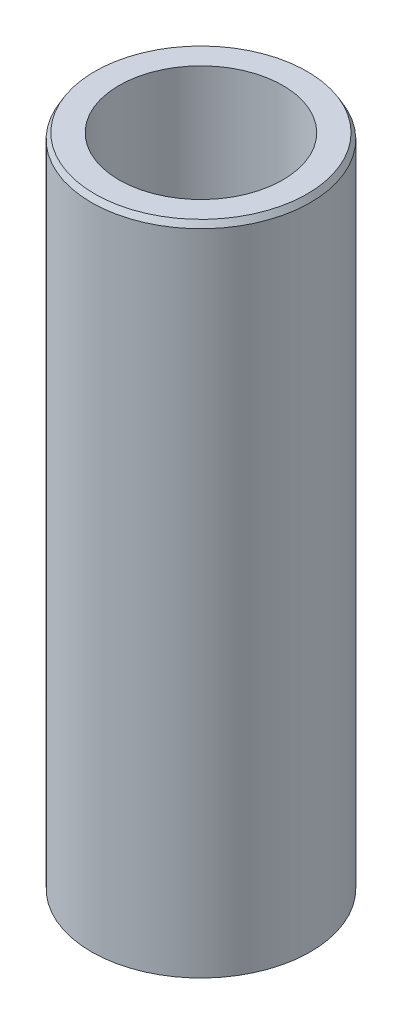
ISO-10303-21;
HEADER;
FILE_DESCRIPTION(('STEP AP214'),'2;1');
FILE_NAME('part.step','',(''),(''),'','','');
FILE_SCHEMA(('AUTOMOTIVE_DESIGN { 1 0 10303 214 1 1 1 1 }'));
ENDSEC;
DATA;
#1=APPLICATION_CONTEXT('core data for automotive mechanical design processes');
#2=APPLICATION_PROTOCOL_DEFINITION('international standard','automotive_design',2000,#1);
#3=PRODUCT_CONTEXT('',#1,'mechanical');
#4=PRODUCT('Part','Part','',(#3));
#5=PRODUCT_RELATED_PRODUCT_CATEGORY('part','',(#4));
#6=PRODUCT_DEFINITION_FORMATION('','',#4);
#7=PRODUCT_DEFINITION_CONTEXT('part definition',#1,'design');
#8=PRODUCT_DEFINITION('design','',#6,#7);
#9=PRODUCT_DEFINITION_SHAPE('','',#8);
#10=(LENGTH_UNIT() NAMED_UNIT(*) SI_UNIT(.MILLI.,.METRE.));
#11=(NAMED_UNIT(*) PLANE_ANGLE_UNIT() SI_UNIT($,.RADIAN.));
#12=(NAMED_UNIT(*) SI_UNIT($,.STERADIAN.) SOLID_ANGLE_UNIT());
#13=UNCERTAINTY_MEASURE_WITH_UNIT(LENGTH_MEASURE(1.E-05),#10,'distance_accuracy_value','');
#14=(GEOMETRIC_REPRESENTATION_CONTEXT(3) GLOBAL_UNCERTAINTY_ASSIGNED_CONTEXT((#13)) GLOBAL_UNIT_ASSIGNED_CONTEXT((#10,
#11,#12)) REPRESENTATION_CONTEXT('',''));
#15=CARTESIAN_POINT('',(0.,0.,0.));
#16=DIRECTION('',(0.,0.,1.));
#17=DIRECTION('',(1.,0.,0.));
#18=AXIS2_PLACEMENT_3D('',#15,#16,#17);
#19=CARTESIAN_POINT('',(0.,90.1346399040688,0.));
#20=DIRECTION('',(0.,-1.,0.));
#21=DIRECTION('',(0.,0.,-1.));
#22=AXIS2_PLACEMENT_3D('',#19,#20,#21);
#23=CYLINDRICAL_SURFACE('',#22,15.);
#24=CARTESIAN_POINT('',(0.,89.3441421002694,0.));
#25=DIRECTION('',(0.,1.,0.));
#26=DIRECTION('',(0.,0.,1.));
#27=AXIS2_PLACEMENT_3D('',#24,#25,#26);
#28=CIRCLE('',#27,15.);
#29=CARTESIAN_POINT('',(0.,89.3441421002694,15.));
#30=VERTEX_POINT('',#29);
#31=EDGE_CURVE('E50',#30,#30,#28,.F.);
#32=ORIENTED_EDGE('',*,*,#31,.T.);
#33=EDGE_LOOP('',(#32));
#34=FACE_BOUND('',#33,.T.);
#35=CARTESIAN_POINT('',(0.,0.456394119817377,0.));
#36=DIRECTION('',(0.,1.,0.));
#37=DIRECTION('',(0.,0.,1.));
#38=AXIS2_PLACEMENT_3D('',#35,#36,#37);
#39=CIRCLE('',#38,15.);
#40=CARTESIAN_POINT('',(0.,0.456394119817377,15.));
#41=VERTEX_POINT('',#40);
#42=EDGE_CURVE('E51',#41,#41,#39,.T.);
#43=ORIENTED_EDGE('',*,*,#42,.T.);
#44=EDGE_LOOP('',(#43));
#45=FACE_BOUND('',#44,.T.);
#46=ADVANCED_FACE('F39',(#34,#45),#23,.T.);
#47=CARTESIAN_POINT('',(0.,90.1346399040688,0.));
#48=DIRECTION('',(0.,1.,0.));
#49=DIRECTION('',(0.,0.,1.));
#50=AXIS2_PLACEMENT_3D('',#47,#48,#49);
#51=PLANE('',#50);
#52=CARTESIAN_POINT('',(0.,90.1346399040688,0.));
#53=DIRECTION('',(0.,1.,0.));
#54=DIRECTION('',(0.,0.,1.));
#55=AXIS2_PLACEMENT_3D('',#52,#53,#54);
#56=CIRCLE('',#55,14.5436058801826);
#57=CARTESIAN_POINT('',(0.,90.1346399040688,14.5436058801826));
#58=VERTEX_POINT('',#57);
#59=EDGE_CURVE('E54',#58,#58,#56,.T.);
#60=ORIENTED_EDGE('',*,*,#59,.T.);
#61=EDGE_LOOP('',(#60));
#62=FACE_BOUND('',#61,.T.);
#63=CARTESIAN_POINT('',(0.,90.1346399040688,0.));
#64=DIRECTION('',(0.,1.,0.));
#65=DIRECTION('',(0.,0.,1.));
#66=AXIS2_PLACEMENT_3D('',#63,#64,#65);
#67=CIRCLE('',#66,11.2185413076946);
#68=CARTESIAN_POINT('',(0.,90.1346399040688,11.2185413076946));
#69=VERTEX_POINT('',#68);
#70=EDGE_CURVE('E58',#69,#69,#67,.T.);
#71=ORIENTED_EDGE('',*,*,#70,.F.);
#72=EDGE_LOOP('',(#71));
#73=FACE_BOUND('',#72,.T.);
#74=ADVANCED_FACE('F69',(#62,#73),#51,.T.);
#75=CARTESIAN_POINT('',(0.,0.,0.));
#76=DIRECTION('',(0.,1.,0.));
#77=DIRECTION('',(0.,0.,1.));
#78=AXIS2_PLACEMENT_3D('',#75,#76,#77);
#79=PLANE('',#78);
#80=CARTESIAN_POINT('',(0.,0.,0.));
#81=DIRECTION('',(0.,1.,0.));
#82=DIRECTION('',(0.,0.,1.));
#83=AXIS2_PLACEMENT_3D('',#80,#81,#82);
#84=CIRCLE('',#83,14.2095021962006);
#85=CARTESIAN_POINT('',(0.,0.,14.2095021962006));
#86=VERTEX_POINT('',#85);
#87=EDGE_CURVE('E10',#86,#86,#84,.F.);
#88=ORIENTED_EDGE('',*,*,#87,.T.);
#89=EDGE_LOOP('',(#88));
#90=FACE_BOUND('',#89,.T.);
#91=CARTESIAN_POINT('',(0.,0.,0.));
#92=DIRECTION('',(0.,1.,0.));
#93=DIRECTION('',(0.,0.,1.));
#94=AXIS2_PLACEMENT_3D('',#91,#92,#93);
#95=CIRCLE('',#94,11.2185413076946);
#96=CARTESIAN_POINT('',(0.,0.,11.2185413076946));
#97=VERTEX_POINT('',#96);
#98=EDGE_CURVE('E63',#97,#97,#95,.T.);
#99=ORIENTED_EDGE('',*,*,#98,.T.);
#100=EDGE_LOOP('',(#99));
#101=FACE_BOUND('',#100,.T.);
#102=ADVANCED_FACE('F75',(#90,#101),#79,.F.);
#103=CARTESIAN_POINT('',(0.,90.1346399040688,0.));
#104=DIRECTION('',(0.,-1.,0.));
#105=DIRECTION('',(0.,0.,-1.));
#106=AXIS2_PLACEMENT_3D('',#103,#104,#105);
#107=CYLINDRICAL_SURFACE('',#106,11.2185413076946);
#108=ORIENTED_EDGE('',*,*,#70,.T.);
#109=EDGE_LOOP('',(#108));
#110=FACE_BOUND('',#109,.T.);
#111=ORIENTED_EDGE('',*,*,#98,.F.);
#112=EDGE_LOOP('',(#111));
#113=FACE_BOUND('',#112,.T.);
#114=ADVANCED_FACE('F70',(#110,#113),#107,.F.);
#115=CARTESIAN_POINT('',(0.,90.1346399040688,0.));
#116=DIRECTION('',(0.,-1.,0.));
#117=DIRECTION('',(0.,0.,-1.));
#118=AXIS2_PLACEMENT_3D('',#115,#116,#117);
#119=CONICAL_SURFACE('',#118,14.5436058801826,0.5235987755983);
#120=ORIENTED_EDGE('',*,*,#31,.F.);
#121=EDGE_LOOP('',(#120));
#122=FACE_BOUND('',#121,.T.);
#123=ORIENTED_EDGE('',*,*,#59,.F.);
#124=EDGE_LOOP('',(#123));
#125=FACE_BOUND('',#124,.T.);
#126=ADVANCED_FACE('F81',(#122,#125),#119,.T.);
#127=CARTESIAN_POINT('',(0.,0.456394119817377,0.));
#128=DIRECTION('',(0.,1.,0.));
#129=DIRECTION('',(0.,0.,1.));
#130=AXIS2_PLACEMENT_3D('',#127,#128,#129);
#131=CONICAL_SURFACE('',#130,15.,1.0471975511966);
#132=ORIENTED_EDGE('',*,*,#87,.F.);
#133=EDGE_LOOP('',(#132));
#134=FACE_BOUND('',#133,.T.);
#135=ORIENTED_EDGE('',*,*,#42,.F.);
#136=EDGE_LOOP('',(#135));
#137=FACE_BOUND('',#136,.T.);
#138=ADVANCED_FACE('F45',(#134,#137),#131,.T.);
#139=CLOSED_SHELL('',(#46,#74,#102,#114,#126,#138));
#140=MANIFOLD_SOLID_BREP('B2',#139);
#141=ADVANCED_BREP_SHAPE_REPRESENTATION('',(#18,#140),#14);
#142=SHAPE_DEFINITION_REPRESENTATION(#9,#141);
ENDSEC;
END-ISO-10303-21;
